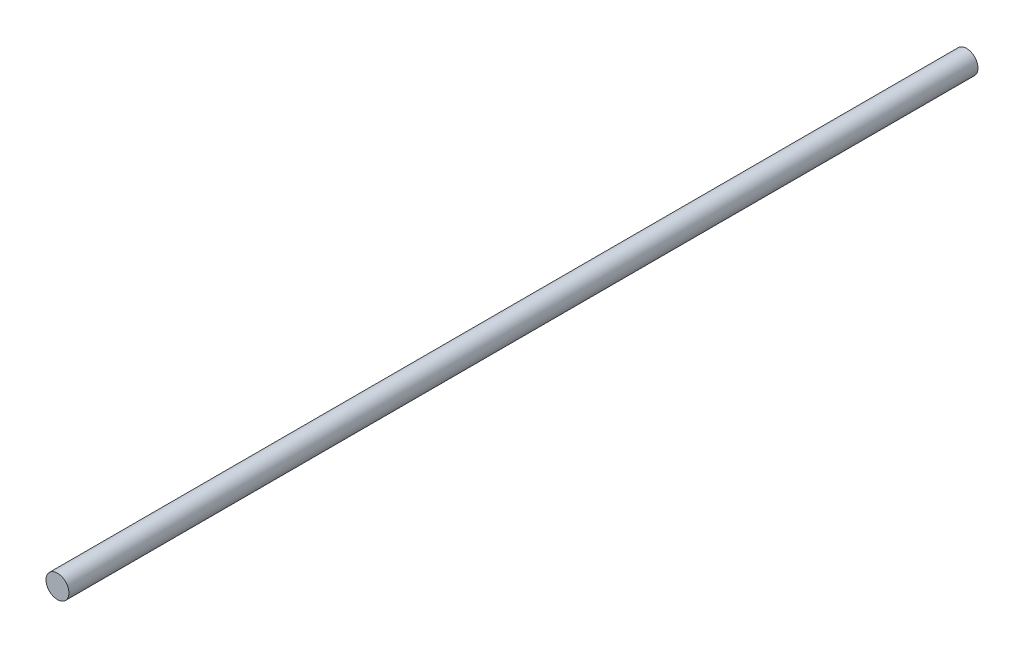
ISO-10303-21;
HEADER;
FILE_DESCRIPTION(('STEP AP214'),'2;1');
FILE_NAME('part.step','',(''),(''),'','','');
FILE_SCHEMA(('AUTOMOTIVE_DESIGN { 1 0 10303 214 1 1 1 1 }'));
ENDSEC;
DATA;
#1=APPLICATION_CONTEXT('core data for automotive mechanical design processes');
#2=APPLICATION_PROTOCOL_DEFINITION('international standard','automotive_design',2000,#1);
#3=PRODUCT_CONTEXT('',#1,'mechanical');
#4=PRODUCT('Part','Part','',(#3));
#5=PRODUCT_RELATED_PRODUCT_CATEGORY('part','',(#4));
#6=PRODUCT_DEFINITION_FORMATION('','',#4);
#7=PRODUCT_DEFINITION_CONTEXT('part definition',#1,'design');
#8=PRODUCT_DEFINITION('design','',#6,#7);
#9=PRODUCT_DEFINITION_SHAPE('','',#8);
#10=(LENGTH_UNIT() NAMED_UNIT(*) SI_UNIT(.MILLI.,.METRE.));
#11=(NAMED_UNIT(*) PLANE_ANGLE_UNIT() SI_UNIT($,.RADIAN.));
#12=(NAMED_UNIT(*) SI_UNIT($,.STERADIAN.) SOLID_ANGLE_UNIT());
#13=UNCERTAINTY_MEASURE_WITH_UNIT(LENGTH_MEASURE(1.E-05),#10,'distance_accuracy_value','');
#14=(GEOMETRIC_REPRESENTATION_CONTEXT(3) GLOBAL_UNCERTAINTY_ASSIGNED_CONTEXT((#13)) GLOBAL_UNIT_ASSIGNED_CONTEXT((#10,
#11,#12)) REPRESENTATION_CONTEXT('',''));
#15=CARTESIAN_POINT('',(0.,0.,0.));
#16=DIRECTION('',(0.,0.,1.));
#17=DIRECTION('',(1.,0.,0.));
#18=AXIS2_PLACEMENT_3D('',#15,#16,#17);
#19=CARTESIAN_POINT('',(0.,0.,158.5));
#20=DIRECTION('',(0.,0.,-1.));
#21=DIRECTION('',(-1.,0.,0.));
#22=AXIS2_PLACEMENT_3D('',#19,#20,#21);
#23=CYLINDRICAL_SURFACE('',#22,4.);
#24=CARTESIAN_POINT('',(0.,0.,158.5));
#25=DIRECTION('',(0.,0.,1.));
#26=DIRECTION('',(1.,0.,0.));
#27=AXIS2_PLACEMENT_3D('',#24,#25,#26);
#28=CIRCLE('',#27,4.);
#29=CARTESIAN_POINT('',(4.,0.,158.5));
#30=VERTEX_POINT('',#29);
#31=EDGE_CURVE('E10',#30,#30,#28,.T.);
#32=ORIENTED_EDGE('',*,*,#31,.F.);
#33=EDGE_LOOP('',(#32));
#34=FACE_BOUND('',#33,.T.);
#35=CARTESIAN_POINT('',(0.,0.,-158.5));
#36=DIRECTION('',(0.,0.,1.));
#37=DIRECTION('',(1.,0.,0.));
#38=AXIS2_PLACEMENT_3D('',#35,#36,#37);
#39=CIRCLE('',#38,4.);
#40=CARTESIAN_POINT('',(4.,0.,-158.5));
#41=VERTEX_POINT('',#40);
#42=EDGE_CURVE('E33',#41,#41,#39,.T.);
#43=ORIENTED_EDGE('',*,*,#42,.T.);
#44=EDGE_LOOP('',(#43));
#45=FACE_BOUND('',#44,.T.);
#46=ADVANCED_FACE('F30',(#34,#45),#23,.T.);
#47=CARTESIAN_POINT('',(0.,0.,158.5));
#48=DIRECTION('',(0.,0.,1.));
#49=DIRECTION('',(1.,0.,0.));
#50=AXIS2_PLACEMENT_3D('',#47,#48,#49);
#51=PLANE('',#50);
#52=ORIENTED_EDGE('',*,*,#31,.T.);
#53=EDGE_LOOP('',(#52));
#54=FACE_BOUND('',#53,.T.);
#55=ADVANCED_FACE('F45',(#54),#51,.T.);
#56=CARTESIAN_POINT('',(0.,0.,-158.5));
#57=DIRECTION('',(0.,0.,1.));
#58=DIRECTION('',(1.,0.,0.));
#59=AXIS2_PLACEMENT_3D('',#56,#57,#58);
#60=PLANE('',#59);
#61=ORIENTED_EDGE('',*,*,#42,.F.);
#62=EDGE_LOOP('',(#61));
#63=FACE_BOUND('',#62,.T.);
#64=ADVANCED_FACE('F43',(#63),#60,.F.);
#65=CLOSED_SHELL('',(#46,#55,#64));
#66=MANIFOLD_SOLID_BREP('B2',#65);
#67=ADVANCED_BREP_SHAPE_REPRESENTATION('',(#18,#66),#14);
#68=SHAPE_DEFINITION_REPRESENTATION(#9,#67);
ENDSEC;
END-ISO-10303-21;
